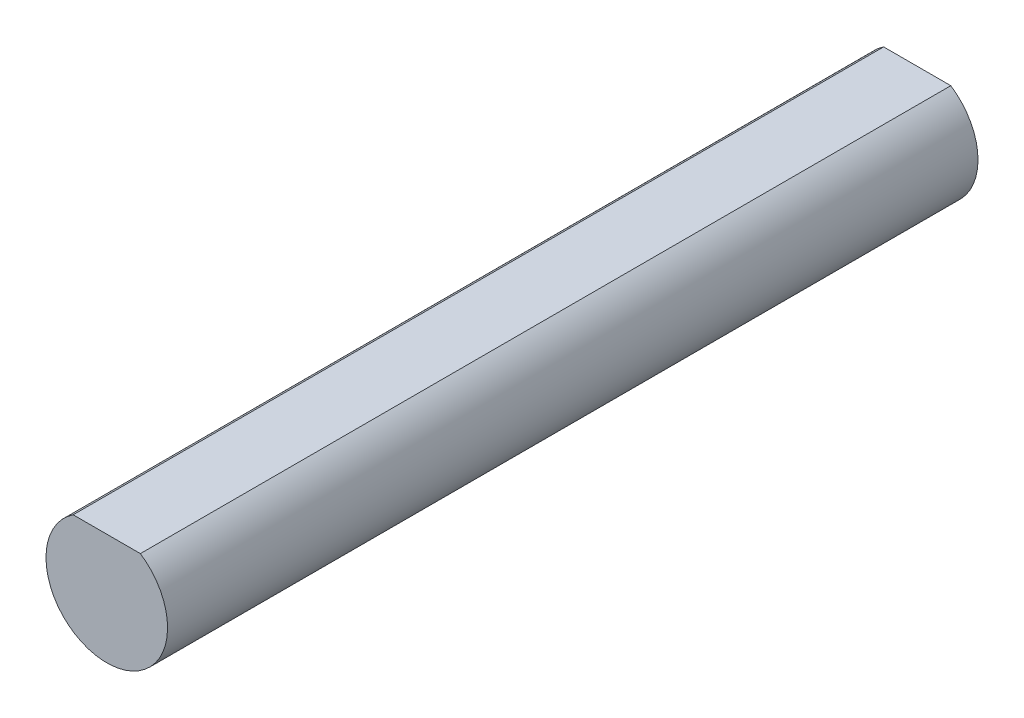
ISO-10303-21;
HEADER;
FILE_DESCRIPTION(('STEP AP214'),'2;1');
FILE_NAME('part.step','',(''),(''),'','','');
FILE_SCHEMA(('AUTOMOTIVE_DESIGN { 1 0 10303 214 1 1 1 1 }'));
ENDSEC;
DATA;
#1=APPLICATION_CONTEXT('core data for automotive mechanical design processes');
#2=APPLICATION_PROTOCOL_DEFINITION('international standard','automotive_design',2000,#1);
#3=PRODUCT_CONTEXT('',#1,'mechanical');
#4=PRODUCT('Part','Part','',(#3));
#5=PRODUCT_RELATED_PRODUCT_CATEGORY('part','',(#4));
#6=PRODUCT_DEFINITION_FORMATION('','',#4);
#7=PRODUCT_DEFINITION_CONTEXT('part definition',#1,'design');
#8=PRODUCT_DEFINITION('design','',#6,#7);
#9=PRODUCT_DEFINITION_SHAPE('','',#8);
#10=(LENGTH_UNIT() NAMED_UNIT(*) SI_UNIT(.MILLI.,.METRE.));
#11=(NAMED_UNIT(*) PLANE_ANGLE_UNIT() SI_UNIT($,.RADIAN.));
#12=(NAMED_UNIT(*) SI_UNIT($,.STERADIAN.) SOLID_ANGLE_UNIT());
#13=UNCERTAINTY_MEASURE_WITH_UNIT(LENGTH_MEASURE(1.E-05),#10,'distance_accuracy_value','');
#14=(GEOMETRIC_REPRESENTATION_CONTEXT(3) GLOBAL_UNCERTAINTY_ASSIGNED_CONTEXT((#13)) GLOBAL_UNIT_ASSIGNED_CONTEXT((#10,
#11,#12)) REPRESENTATION_CONTEXT('',''));
#15=CARTESIAN_POINT('',(0.,0.,0.));
#16=DIRECTION('',(0.,0.,1.));
#17=DIRECTION('',(1.,0.,0.));
#18=AXIS2_PLACEMENT_3D('',#15,#16,#17);
#19=CARTESIAN_POINT('',(0.,0.,40.));
#20=DIRECTION('',(0.,0.,-1.));
#21=DIRECTION('',(-1.,0.,0.));
#22=AXIS2_PLACEMENT_3D('',#19,#20,#21);
#23=CYLINDRICAL_SURFACE('',#22,3.);
#24=CARTESIAN_POINT('',(0.,0.,0.));
#25=DIRECTION('',(0.,0.,1.));
#26=DIRECTION('',(1.,0.,0.));
#27=AXIS2_PLACEMENT_3D('',#24,#25,#26);
#28=CIRCLE('',#27,3.);
#29=CARTESIAN_POINT('',(-1.6583123951777,2.5,0.));
#30=VERTEX_POINT('',#29);
#31=CARTESIAN_POINT('',(1.6583123951777,2.5,0.));
#32=VERTEX_POINT('',#31);
#33=EDGE_CURVE('E65',#30,#32,#28,.T.);
#34=ORIENTED_EDGE('',*,*,#33,.T.);
#35=DIRECTION('',(0.,0.,-1.));
#36=VECTOR('',#35,1.);
#37=CARTESIAN_POINT('',(1.6583123951777,2.5,40.));
#38=LINE('',#37,#36);
#39=CARTESIAN_POINT('',(1.6583123951777,2.5,40.));
#40=VERTEX_POINT('',#39);
#41=EDGE_CURVE('E11',#40,#32,#38,.T.);
#42=ORIENTED_EDGE('',*,*,#41,.F.);
#43=CARTESIAN_POINT('',(0.,0.,40.));
#44=DIRECTION('',(0.,0.,1.));
#45=DIRECTION('',(1.,0.,0.));
#46=AXIS2_PLACEMENT_3D('',#43,#44,#45);
#47=CIRCLE('',#46,3.);
#48=CARTESIAN_POINT('',(-1.6583123951777,2.5,40.));
#49=VERTEX_POINT('',#48);
#50=EDGE_CURVE('E64',#49,#40,#47,.T.);
#51=ORIENTED_EDGE('',*,*,#50,.F.);
#52=DIRECTION('',(0.,0.,-1.));
#53=VECTOR('',#52,1.);
#54=CARTESIAN_POINT('',(-1.6583123951777,2.5,40.));
#55=LINE('',#54,#53);
#56=EDGE_CURVE('E42',#49,#30,#55,.T.);
#57=ORIENTED_EDGE('',*,*,#56,.T.);
#58=EDGE_LOOP('',(#34,#42,#51,#57));
#59=FACE_BOUND('',#58,.T.);
#60=ADVANCED_FACE('F34',(#59),#23,.T.);
#61=CARTESIAN_POINT('',(-1.6583123951777,2.5,40.));
#62=DIRECTION('',(0.,-1.,0.));
#63=DIRECTION('',(0.,0.,-1.));
#64=AXIS2_PLACEMENT_3D('',#61,#62,#63);
#65=PLANE('',#64);
#66=DIRECTION('',(-1.,0.,0.));
#67=VECTOR('',#66,1.);
#68=CARTESIAN_POINT('',(-1.6583123951777,2.5,0.));
#69=LINE('',#68,#67);
#70=EDGE_CURVE('E57',#32,#30,#69,.T.);
#71=ORIENTED_EDGE('',*,*,#70,.T.);
#72=ORIENTED_EDGE('',*,*,#56,.F.);
#73=DIRECTION('',(-1.,0.,0.));
#74=VECTOR('',#73,1.);
#75=CARTESIAN_POINT('',(-1.6583123951777,2.5,40.));
#76=LINE('',#75,#74);
#77=EDGE_CURVE('E49',#40,#49,#76,.T.);
#78=ORIENTED_EDGE('',*,*,#77,.F.);
#79=ORIENTED_EDGE('',*,*,#41,.T.);
#80=EDGE_LOOP('',(#71,#72,#78,#79));
#81=FACE_BOUND('',#80,.T.);
#82=ADVANCED_FACE('F60',(#81),#65,.F.);
#83=CARTESIAN_POINT('',(0.,0.,40.));
#84=DIRECTION('',(0.,0.,1.));
#85=DIRECTION('',(1.,0.,0.));
#86=AXIS2_PLACEMENT_3D('',#83,#84,#85);
#87=PLANE('',#86);
#88=ORIENTED_EDGE('',*,*,#50,.T.);
#89=ORIENTED_EDGE('',*,*,#77,.T.);
#90=EDGE_LOOP('',(#88,#89));
#91=FACE_BOUND('',#90,.T.);
#92=ADVANCED_FACE('F72',(#91),#87,.T.);
#93=CARTESIAN_POINT('',(0.,0.,0.));
#94=DIRECTION('',(0.,0.,1.));
#95=DIRECTION('',(1.,0.,0.));
#96=AXIS2_PLACEMENT_3D('',#93,#94,#95);
#97=PLANE('',#96);
#98=ORIENTED_EDGE('',*,*,#33,.F.);
#99=ORIENTED_EDGE('',*,*,#70,.F.);
#100=EDGE_LOOP('',(#98,#99));
#101=FACE_BOUND('',#100,.T.);
#102=ADVANCED_FACE('F68',(#101),#97,.F.);
#103=CLOSED_SHELL('',(#60,#82,#92,#102));
#104=MANIFOLD_SOLID_BREP('B2',#103);
#105=ADVANCED_BREP_SHAPE_REPRESENTATION('',(#18,#104),#14);
#106=SHAPE_DEFINITION_REPRESENTATION(#9,#105);
ENDSEC;
END-ISO-10303-21;
